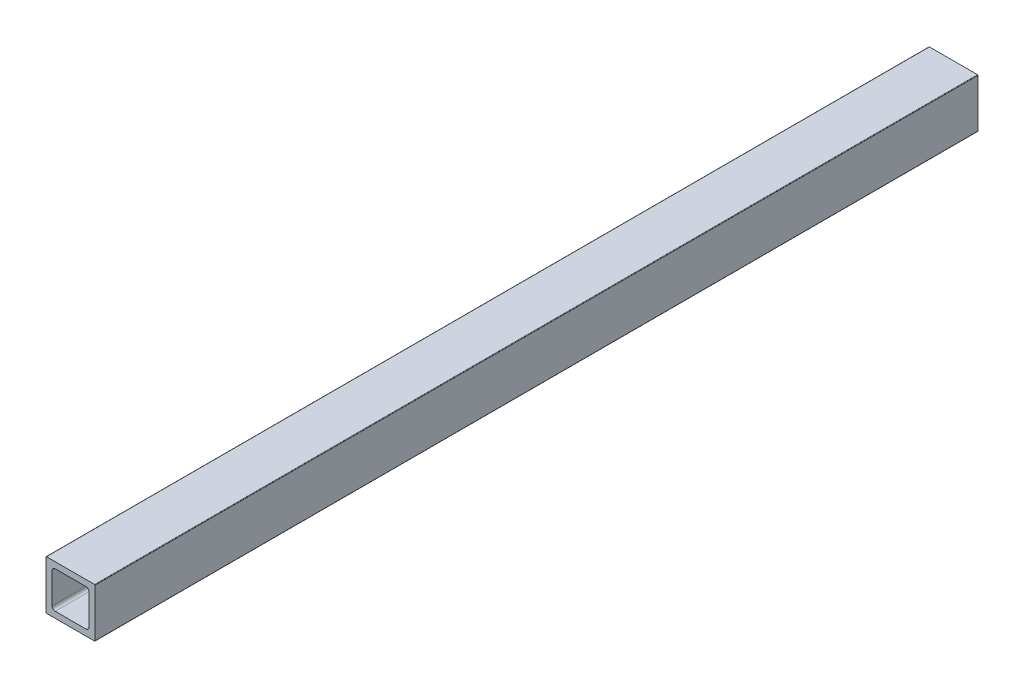
ISO-10303-21;
HEADER;
FILE_DESCRIPTION(('STEP AP214'),'2;1');
FILE_NAME('part.step','',(''),(''),'','','');
FILE_SCHEMA(('AUTOMOTIVE_DESIGN { 1 0 10303 214 1 1 1 1 }'));
ENDSEC;
DATA;
#1=APPLICATION_CONTEXT('core data for automotive mechanical design processes');
#2=APPLICATION_PROTOCOL_DEFINITION('international standard','automotive_design',2000,#1);
#3=PRODUCT_CONTEXT('',#1,'mechanical');
#4=PRODUCT('Part','Part','',(#3));
#5=PRODUCT_RELATED_PRODUCT_CATEGORY('part','',(#4));
#6=PRODUCT_DEFINITION_FORMATION('','',#4);
#7=PRODUCT_DEFINITION_CONTEXT('part definition',#1,'design');
#8=PRODUCT_DEFINITION('design','',#6,#7);
#9=PRODUCT_DEFINITION_SHAPE('','',#8);
#10=(LENGTH_UNIT() NAMED_UNIT(*) SI_UNIT(.MILLI.,.METRE.));
#11=(NAMED_UNIT(*) PLANE_ANGLE_UNIT() SI_UNIT($,.RADIAN.));
#12=(NAMED_UNIT(*) SI_UNIT($,.STERADIAN.) SOLID_ANGLE_UNIT());
#13=UNCERTAINTY_MEASURE_WITH_UNIT(LENGTH_MEASURE(1.E-05),#10,'distance_accuracy_value','');
#14=(GEOMETRIC_REPRESENTATION_CONTEXT(3) GLOBAL_UNCERTAINTY_ASSIGNED_CONTEXT((#13)) GLOBAL_UNIT_ASSIGNED_CONTEXT((#10,
#11,#12)) REPRESENTATION_CONTEXT('',''));
#15=CARTESIAN_POINT('',(0.,0.,0.));
#16=DIRECTION('',(0.,0.,1.));
#17=DIRECTION('',(1.,0.,0.));
#18=AXIS2_PLACEMENT_3D('',#15,#16,#17);
#19=CARTESIAN_POINT('',(0.253999999999993,0.253999999999998,457.2));
#20=DIRECTION('',(0.,0.,-1.));
#21=DIRECTION('',(-1.,0.,0.));
#22=AXIS2_PLACEMENT_3D('',#19,#20,#21);
#23=CYLINDRICAL_SURFACE('',#22,0.253999999999997);
#24=CARTESIAN_POINT('',(0.253999999999993,0.253999999999998,0.));
#25=DIRECTION('',(0.,0.,-1.));
#26=DIRECTION('',(-1.,0.,0.));
#27=AXIS2_PLACEMENT_3D('',#24,#25,#26);
#28=CIRCLE('',#27,0.253999999999997);
#29=CARTESIAN_POINT('',(0.253999999999993,0.,0.));
#30=VERTEX_POINT('',#29);
#31=CARTESIAN_POINT('',(0.,0.253999999999998,0.));
#32=VERTEX_POINT('',#31);
#33=EDGE_CURVE('E203',#30,#32,#28,.T.);
#34=ORIENTED_EDGE('',*,*,#33,.F.);
#35=DIRECTION('',(0.,0.,-1.));
#36=VECTOR('',#35,1.);
#37=CARTESIAN_POINT('',(0.253999999999993,0.,457.2));
#38=LINE('',#37,#36);
#39=CARTESIAN_POINT('',(0.253999999999993,0.,457.2));
#40=VERTEX_POINT('',#39);
#41=EDGE_CURVE('E11',#40,#30,#38,.T.);
#42=ORIENTED_EDGE('',*,*,#41,.F.);
#43=CARTESIAN_POINT('',(0.253999999999993,0.253999999999998,457.2));
#44=DIRECTION('',(0.,0.,-1.));
#45=DIRECTION('',(-1.,0.,0.));
#46=AXIS2_PLACEMENT_3D('',#43,#44,#45);
#47=CIRCLE('',#46,0.253999999999997);
#48=CARTESIAN_POINT('',(0.,0.253999999999998,457.2));
#49=VERTEX_POINT('',#48);
#50=EDGE_CURVE('E215',#40,#49,#47,.T.);
#51=ORIENTED_EDGE('',*,*,#50,.T.);
#52=DIRECTION('',(0.,0.,-1.));
#53=VECTOR('',#52,1.);
#54=CARTESIAN_POINT('',(0.,0.253999999999998,457.2));
#55=LINE('',#54,#53);
#56=EDGE_CURVE('E36',#49,#32,#55,.T.);
#57=ORIENTED_EDGE('',*,*,#56,.T.);
#58=EDGE_LOOP('',(#34,#42,#51,#57));
#59=FACE_BOUND('',#58,.T.);
#60=ADVANCED_FACE('F33',(#59),#23,.T.);
#61=CARTESIAN_POINT('',(25.146,0.,457.2));
#62=DIRECTION('',(0.,-1.,0.));
#63=DIRECTION('',(1.,0.,0.));
#64=AXIS2_PLACEMENT_3D('',#61,#62,#63);
#65=PLANE('',#64);
#66=DIRECTION('',(-1.,0.,0.));
#67=VECTOR('',#66,1.);
#68=CARTESIAN_POINT('',(25.146,0.,0.));
#69=LINE('',#68,#67);
#70=CARTESIAN_POINT('',(25.146,0.,0.));
#71=VERTEX_POINT('',#70);
#72=EDGE_CURVE('E219',#71,#30,#69,.T.);
#73=ORIENTED_EDGE('',*,*,#72,.F.);
#74=DIRECTION('',(0.,0.,-1.));
#75=VECTOR('',#74,1.);
#76=CARTESIAN_POINT('',(25.146,0.,457.2));
#77=LINE('',#76,#75);
#78=CARTESIAN_POINT('',(25.146,0.,457.2));
#79=VERTEX_POINT('',#78);
#80=EDGE_CURVE('E41',#79,#71,#77,.T.);
#81=ORIENTED_EDGE('',*,*,#80,.F.);
#82=DIRECTION('',(-1.,0.,0.));
#83=VECTOR('',#82,1.);
#84=CARTESIAN_POINT('',(25.146,0.,457.2));
#85=LINE('',#84,#83);
#86=EDGE_CURVE('E237',#79,#40,#85,.T.);
#87=ORIENTED_EDGE('',*,*,#86,.T.);
#88=ORIENTED_EDGE('',*,*,#41,.T.);
#89=EDGE_LOOP('',(#73,#81,#87,#88));
#90=FACE_BOUND('',#89,.T.);
#91=ADVANCED_FACE('F284',(#90),#65,.T.);
#92=CARTESIAN_POINT('',(25.146,0.254,457.2));
#93=DIRECTION('',(0.,0.,-1.));
#94=DIRECTION('',(-1.,0.,0.));
#95=AXIS2_PLACEMENT_3D('',#92,#93,#94);
#96=CYLINDRICAL_SURFACE('',#95,0.253999999999999);
#97=CARTESIAN_POINT('',(25.146,0.254,0.));
#98=DIRECTION('',(0.,0.,-1.));
#99=DIRECTION('',(-1.,0.,0.));
#100=AXIS2_PLACEMENT_3D('',#97,#98,#99);
#101=CIRCLE('',#100,0.253999999999999);
#102=CARTESIAN_POINT('',(25.4,0.254,0.));
#103=VERTEX_POINT('',#102);
#104=EDGE_CURVE('E257',#103,#71,#101,.T.);
#105=ORIENTED_EDGE('',*,*,#104,.F.);
#106=DIRECTION('',(0.,0.,-1.));
#107=VECTOR('',#106,1.);
#108=CARTESIAN_POINT('',(25.4,0.254,457.2));
#109=LINE('',#108,#107);
#110=CARTESIAN_POINT('',(25.4,0.254,457.2));
#111=VERTEX_POINT('',#110);
#112=EDGE_CURVE('E263',#111,#103,#109,.T.);
#113=ORIENTED_EDGE('',*,*,#112,.F.);
#114=CARTESIAN_POINT('',(25.146,0.254,457.2));
#115=DIRECTION('',(0.,0.,-1.));
#116=DIRECTION('',(-1.,0.,0.));
#117=AXIS2_PLACEMENT_3D('',#114,#115,#116);
#118=CIRCLE('',#117,0.253999999999999);
#119=EDGE_CURVE('E234',#111,#79,#118,.T.);
#120=ORIENTED_EDGE('',*,*,#119,.T.);
#121=ORIENTED_EDGE('',*,*,#80,.T.);
#122=EDGE_LOOP('',(#105,#113,#120,#121));
#123=FACE_BOUND('',#122,.T.);
#124=ADVANCED_FACE('F303',(#123),#96,.T.);
#125=CARTESIAN_POINT('',(25.4,25.146,457.2));
#126=DIRECTION('',(1.,0.,0.));
#127=DIRECTION('',(0.,0.,-1.));
#128=AXIS2_PLACEMENT_3D('',#125,#126,#127);
#129=PLANE('',#128);
#130=DIRECTION('',(0.,-1.,0.));
#131=VECTOR('',#130,1.);
#132=CARTESIAN_POINT('',(25.4,25.146,0.));
#133=LINE('',#132,#131);
#134=CARTESIAN_POINT('',(25.4,25.146,0.));
#135=VERTEX_POINT('',#134);
#136=EDGE_CURVE('E254',#135,#103,#133,.T.);
#137=ORIENTED_EDGE('',*,*,#136,.F.);
#138=DIRECTION('',(0.,0.,-1.));
#139=VECTOR('',#138,1.);
#140=CARTESIAN_POINT('',(25.4,25.146,457.2));
#141=LINE('',#140,#139);
#142=CARTESIAN_POINT('',(25.4,25.146,457.2));
#143=VERTEX_POINT('',#142);
#144=EDGE_CURVE('E265',#143,#135,#141,.T.);
#145=ORIENTED_EDGE('',*,*,#144,.F.);
#146=DIRECTION('',(0.,-1.,0.));
#147=VECTOR('',#146,1.);
#148=CARTESIAN_POINT('',(25.4,25.146,457.2));
#149=LINE('',#148,#147);
#150=EDGE_CURVE('E231',#143,#111,#149,.T.);
#151=ORIENTED_EDGE('',*,*,#150,.T.);
#152=ORIENTED_EDGE('',*,*,#112,.T.);
#153=EDGE_LOOP('',(#137,#145,#151,#152));
#154=FACE_BOUND('',#153,.T.);
#155=ADVANCED_FACE('F301',(#154),#129,.T.);
#156=CARTESIAN_POINT('',(25.146,25.146,457.2));
#157=DIRECTION('',(0.,0.,-1.));
#158=DIRECTION('',(-1.,0.,0.));
#159=AXIS2_PLACEMENT_3D('',#156,#157,#158);
#160=CYLINDRICAL_SURFACE('',#159,0.253999999999999);
#161=CARTESIAN_POINT('',(25.146,25.146,0.));
#162=DIRECTION('',(0.,0.,-1.));
#163=DIRECTION('',(-1.,0.,0.));
#164=AXIS2_PLACEMENT_3D('',#161,#162,#163);
#165=CIRCLE('',#164,0.253999999999999);
#166=CARTESIAN_POINT('',(25.146,25.4,0.));
#167=VERTEX_POINT('',#166);
#168=EDGE_CURVE('E251',#167,#135,#165,.T.);
#169=ORIENTED_EDGE('',*,*,#168,.F.);
#170=DIRECTION('',(0.,0.,-1.));
#171=VECTOR('',#170,1.);
#172=CARTESIAN_POINT('',(25.146,25.4,457.2));
#173=LINE('',#172,#171);
#174=CARTESIAN_POINT('',(25.146,25.4,457.2));
#175=VERTEX_POINT('',#174);
#176=EDGE_CURVE('E267',#175,#167,#173,.T.);
#177=ORIENTED_EDGE('',*,*,#176,.F.);
#178=CARTESIAN_POINT('',(25.146,25.146,457.2));
#179=DIRECTION('',(0.,0.,-1.));
#180=DIRECTION('',(-1.,0.,0.));
#181=AXIS2_PLACEMENT_3D('',#178,#179,#180);
#182=CIRCLE('',#181,0.253999999999999);
#183=EDGE_CURVE('E228',#175,#143,#182,.T.);
#184=ORIENTED_EDGE('',*,*,#183,.T.);
#185=ORIENTED_EDGE('',*,*,#144,.T.);
#186=EDGE_LOOP('',(#169,#177,#184,#185));
#187=FACE_BOUND('',#186,.T.);
#188=ADVANCED_FACE('F297',(#187),#160,.T.);
#189=CARTESIAN_POINT('',(0.253999999999988,25.4,457.2));
#190=DIRECTION('',(0.,1.,0.));
#191=DIRECTION('',(-1.,0.,0.));
#192=AXIS2_PLACEMENT_3D('',#189,#190,#191);
#193=PLANE('',#192);
#194=DIRECTION('',(1.,0.,0.));
#195=VECTOR('',#194,1.);
#196=CARTESIAN_POINT('',(0.253999999999988,25.4,0.));
#197=LINE('',#196,#195);
#198=CARTESIAN_POINT('',(0.253999999999988,25.4,0.));
#199=VERTEX_POINT('',#198);
#200=EDGE_CURVE('E248',#199,#167,#197,.T.);
#201=ORIENTED_EDGE('',*,*,#200,.F.);
#202=DIRECTION('',(0.,0.,-1.));
#203=VECTOR('',#202,1.);
#204=CARTESIAN_POINT('',(0.253999999999988,25.4,457.2));
#205=LINE('',#204,#203);
#206=CARTESIAN_POINT('',(0.253999999999988,25.4,457.2));
#207=VERTEX_POINT('',#206);
#208=EDGE_CURVE('E269',#207,#199,#205,.T.);
#209=ORIENTED_EDGE('',*,*,#208,.F.);
#210=DIRECTION('',(1.,0.,0.));
#211=VECTOR('',#210,1.);
#212=CARTESIAN_POINT('',(0.253999999999988,25.4,457.2));
#213=LINE('',#212,#211);
#214=EDGE_CURVE('E225',#207,#175,#213,.T.);
#215=ORIENTED_EDGE('',*,*,#214,.T.);
#216=ORIENTED_EDGE('',*,*,#176,.T.);
#217=EDGE_LOOP('',(#201,#209,#215,#216));
#218=FACE_BOUND('',#217,.T.);
#219=ADVANCED_FACE('F295',(#218),#193,.T.);
#220=CARTESIAN_POINT('',(0.253999999999988,25.146,457.2));
#221=DIRECTION('',(0.,0.,-1.));
#222=DIRECTION('',(-1.,0.,0.));
#223=AXIS2_PLACEMENT_3D('',#220,#221,#222);
#224=CYLINDRICAL_SURFACE('',#223,0.253999999999991);
#225=CARTESIAN_POINT('',(0.253999999999988,25.146,0.));
#226=DIRECTION('',(0.,0.,-1.));
#227=DIRECTION('',(-1.,0.,0.));
#228=AXIS2_PLACEMENT_3D('',#225,#226,#227);
#229=CIRCLE('',#228,0.253999999999991);
#230=CARTESIAN_POINT('',(0.,25.146,0.));
#231=VERTEX_POINT('',#230);
#232=EDGE_CURVE('E245',#231,#199,#229,.T.);
#233=ORIENTED_EDGE('',*,*,#232,.F.);
#234=DIRECTION('',(0.,0.,-1.));
#235=VECTOR('',#234,1.);
#236=CARTESIAN_POINT('',(0.,25.146,457.2));
#237=LINE('',#236,#235);
#238=CARTESIAN_POINT('',(0.,25.146,457.2));
#239=VERTEX_POINT('',#238);
#240=EDGE_CURVE('E270',#239,#231,#237,.T.);
#241=ORIENTED_EDGE('',*,*,#240,.F.);
#242=CARTESIAN_POINT('',(0.253999999999988,25.146,457.2));
#243=DIRECTION('',(0.,0.,-1.));
#244=DIRECTION('',(-1.,0.,0.));
#245=AXIS2_PLACEMENT_3D('',#242,#243,#244);
#246=CIRCLE('',#245,0.253999999999991);
#247=EDGE_CURVE('E222',#239,#207,#246,.T.);
#248=ORIENTED_EDGE('',*,*,#247,.T.);
#249=ORIENTED_EDGE('',*,*,#208,.T.);
#250=EDGE_LOOP('',(#233,#241,#248,#249));
#251=FACE_BOUND('',#250,.T.);
#252=ADVANCED_FACE('F291',(#251),#224,.T.);
#253=CARTESIAN_POINT('',(0.,0.253999999999998,457.2));
#254=DIRECTION('',(-1.,0.,0.));
#255=DIRECTION('',(0.,0.,1.));
#256=AXIS2_PLACEMENT_3D('',#253,#254,#255);
#257=PLANE('',#256);
#258=DIRECTION('',(0.,1.,0.));
#259=VECTOR('',#258,1.);
#260=CARTESIAN_POINT('',(0.,0.253999999999998,0.));
#261=LINE('',#260,#259);
#262=EDGE_CURVE('E242',#32,#231,#261,.T.);
#263=ORIENTED_EDGE('',*,*,#262,.F.);
#264=ORIENTED_EDGE('',*,*,#56,.F.);
#265=DIRECTION('',(0.,1.,0.));
#266=VECTOR('',#265,1.);
#267=CARTESIAN_POINT('',(0.,0.253999999999998,457.2));
#268=LINE('',#267,#266);
#269=EDGE_CURVE('E218',#49,#239,#268,.T.);
#270=ORIENTED_EDGE('',*,*,#269,.T.);
#271=ORIENTED_EDGE('',*,*,#240,.T.);
#272=EDGE_LOOP('',(#263,#264,#270,#271));
#273=FACE_BOUND('',#272,.T.);
#274=ADVANCED_FACE('F278',(#273),#257,.T.);
#275=CARTESIAN_POINT('',(0.253999999999993,0.253999999999998,457.2));
#276=DIRECTION('',(0.,0.,-1.));
#277=DIRECTION('',(-1.,0.,0.));
#278=AXIS2_PLACEMENT_3D('',#275,#276,#277);
#279=PLANE('',#278);
#280=DIRECTION('',(0.,1.,0.));
#281=VECTOR('',#280,1.);
#282=CARTESIAN_POINT('',(3.175,20.6375,457.2));
#283=LINE('',#282,#281);
#284=CARTESIAN_POINT('',(3.175,4.7625,457.2));
#285=VERTEX_POINT('',#284);
#286=CARTESIAN_POINT('',(3.175,20.6375,457.2));
#287=VERTEX_POINT('',#286);
#288=EDGE_CURVE('E154',#285,#287,#283,.T.);
#289=ORIENTED_EDGE('',*,*,#288,.T.);
#290=CARTESIAN_POINT('',(4.76250000000001,20.6375,457.2));
#291=DIRECTION('',(0.,0.,-1.));
#292=DIRECTION('',(1.,0.,0.));
#293=AXIS2_PLACEMENT_3D('',#290,#291,#292);
#294=CIRCLE('',#293,1.58750000000001);
#295=CARTESIAN_POINT('',(4.76250000000001,22.225,457.2));
#296=VERTEX_POINT('',#295);
#297=EDGE_CURVE('E148',#287,#296,#294,.T.);
#298=ORIENTED_EDGE('',*,*,#297,.T.);
#299=DIRECTION('',(1.,0.,0.));
#300=VECTOR('',#299,1.);
#301=CARTESIAN_POINT('',(20.6375,22.225,457.2));
#302=LINE('',#301,#300);
#303=CARTESIAN_POINT('',(20.6375,22.225,457.2));
#304=VERTEX_POINT('',#303);
#305=EDGE_CURVE('E157',#296,#304,#302,.T.);
#306=ORIENTED_EDGE('',*,*,#305,.T.);
#307=CARTESIAN_POINT('',(20.6375,20.6375,457.2));
#308=DIRECTION('',(0.,0.,-1.));
#309=DIRECTION('',(1.,0.,0.));
#310=AXIS2_PLACEMENT_3D('',#307,#308,#309);
#311=CIRCLE('',#310,1.5875);
#312=CARTESIAN_POINT('',(22.225,20.6375,457.2));
#313=VERTEX_POINT('',#312);
#314=EDGE_CURVE('E49',#304,#313,#311,.T.);
#315=ORIENTED_EDGE('',*,*,#314,.T.);
#316=DIRECTION('',(0.,-1.,0.));
#317=VECTOR('',#316,1.);
#318=CARTESIAN_POINT('',(22.225,4.7625,457.2));
#319=LINE('',#318,#317);
#320=CARTESIAN_POINT('',(22.225,4.7625,457.2));
#321=VERTEX_POINT('',#320);
#322=EDGE_CURVE('E172',#313,#321,#319,.T.);
#323=ORIENTED_EDGE('',*,*,#322,.T.);
#324=CARTESIAN_POINT('',(20.6375,4.7625,457.2));
#325=DIRECTION('',(0.,0.,-1.));
#326=DIRECTION('',(1.,0.,0.));
#327=AXIS2_PLACEMENT_3D('',#324,#325,#326);
#328=CIRCLE('',#327,1.5875);
#329=CARTESIAN_POINT('',(20.6375,3.175,457.2));
#330=VERTEX_POINT('',#329);
#331=EDGE_CURVE('E175',#321,#330,#328,.T.);
#332=ORIENTED_EDGE('',*,*,#331,.T.);
#333=DIRECTION('',(-1.,0.,0.));
#334=VECTOR('',#333,1.);
#335=CARTESIAN_POINT('',(4.7625,3.175,457.2));
#336=LINE('',#335,#334);
#337=CARTESIAN_POINT('',(4.7625,3.175,457.2));
#338=VERTEX_POINT('',#337);
#339=EDGE_CURVE('E178',#330,#338,#336,.T.);
#340=ORIENTED_EDGE('',*,*,#339,.T.);
#341=CARTESIAN_POINT('',(4.7625,4.7625,457.2));
#342=DIRECTION('',(0.,0.,-1.));
#343=DIRECTION('',(1.,0.,0.));
#344=AXIS2_PLACEMENT_3D('',#341,#342,#343);
#345=CIRCLE('',#344,1.5875);
#346=EDGE_CURVE('E181',#338,#285,#345,.T.);
#347=ORIENTED_EDGE('',*,*,#346,.T.);
#348=EDGE_LOOP('',(#289,#298,#306,#315,#323,#332,#340,#347));
#349=FACE_BOUND('',#348,.T.);
#350=ORIENTED_EDGE('',*,*,#50,.F.);
#351=ORIENTED_EDGE('',*,*,#86,.F.);
#352=ORIENTED_EDGE('',*,*,#119,.F.);
#353=ORIENTED_EDGE('',*,*,#150,.F.);
#354=ORIENTED_EDGE('',*,*,#183,.F.);
#355=ORIENTED_EDGE('',*,*,#214,.F.);
#356=ORIENTED_EDGE('',*,*,#247,.F.);
#357=ORIENTED_EDGE('',*,*,#269,.F.);
#358=EDGE_LOOP('',(#350,#351,#352,#353,#354,#355,#356,#357));
#359=FACE_BOUND('',#358,.T.);
#360=ADVANCED_FACE('F161',(#349,#359),#279,.F.);
#361=CARTESIAN_POINT('',(0.253999999999993,0.253999999999998,0.));
#362=DIRECTION('',(0.,0.,-1.));
#363=DIRECTION('',(-1.,0.,0.));
#364=AXIS2_PLACEMENT_3D('',#361,#362,#363);
#365=PLANE('',#364);
#366=CARTESIAN_POINT('',(4.76250000000001,20.6375,0.));
#367=DIRECTION('',(0.,0.,-1.));
#368=DIRECTION('',(1.,0.,0.));
#369=AXIS2_PLACEMENT_3D('',#366,#367,#368);
#370=CIRCLE('',#369,1.58750000000001);
#371=CARTESIAN_POINT('',(3.175,20.6375,0.));
#372=VERTEX_POINT('',#371);
#373=CARTESIAN_POINT('',(4.76250000000001,22.225,0.));
#374=VERTEX_POINT('',#373);
#375=EDGE_CURVE('E57',#372,#374,#370,.T.);
#376=ORIENTED_EDGE('',*,*,#375,.F.);
#377=DIRECTION('',(0.,1.,0.));
#378=VECTOR('',#377,1.);
#379=CARTESIAN_POINT('',(3.175,20.6375,0.));
#380=LINE('',#379,#378);
#381=CARTESIAN_POINT('',(3.175,4.7625,0.));
#382=VERTEX_POINT('',#381);
#383=EDGE_CURVE('E165',#382,#372,#380,.T.);
#384=ORIENTED_EDGE('',*,*,#383,.F.);
#385=CARTESIAN_POINT('',(4.7625,4.7625,0.));
#386=DIRECTION('',(0.,0.,-1.));
#387=DIRECTION('',(1.,0.,0.));
#388=AXIS2_PLACEMENT_3D('',#385,#386,#387);
#389=CIRCLE('',#388,1.5875);
#390=CARTESIAN_POINT('',(4.7625,3.175,0.));
#391=VERTEX_POINT('',#390);
#392=EDGE_CURVE('E168',#391,#382,#389,.T.);
#393=ORIENTED_EDGE('',*,*,#392,.F.);
#394=DIRECTION('',(-1.,0.,0.));
#395=VECTOR('',#394,1.);
#396=CARTESIAN_POINT('',(4.7625,3.175,0.));
#397=LINE('',#396,#395);
#398=CARTESIAN_POINT('',(20.6375,3.175,0.));
#399=VERTEX_POINT('',#398);
#400=EDGE_CURVE('E196',#399,#391,#397,.T.);
#401=ORIENTED_EDGE('',*,*,#400,.F.);
#402=CARTESIAN_POINT('',(20.6375,4.7625,0.));
#403=DIRECTION('',(0.,0.,-1.));
#404=DIRECTION('',(1.,0.,0.));
#405=AXIS2_PLACEMENT_3D('',#402,#403,#404);
#406=CIRCLE('',#405,1.5875);
#407=CARTESIAN_POINT('',(22.225,4.7625,0.));
#408=VERTEX_POINT('',#407);
#409=EDGE_CURVE('E193',#408,#399,#406,.T.);
#410=ORIENTED_EDGE('',*,*,#409,.F.);
#411=DIRECTION('',(0.,-1.,0.));
#412=VECTOR('',#411,1.);
#413=CARTESIAN_POINT('',(22.225,4.7625,0.));
#414=LINE('',#413,#412);
#415=CARTESIAN_POINT('',(22.225,20.6375,0.));
#416=VERTEX_POINT('',#415);
#417=EDGE_CURVE('E190',#416,#408,#414,.T.);
#418=ORIENTED_EDGE('',*,*,#417,.F.);
#419=CARTESIAN_POINT('',(20.6375,20.6375,0.));
#420=DIRECTION('',(0.,0.,-1.));
#421=DIRECTION('',(1.,0.,0.));
#422=AXIS2_PLACEMENT_3D('',#419,#420,#421);
#423=CIRCLE('',#422,1.5875);
#424=CARTESIAN_POINT('',(20.6375,22.225,0.));
#425=VERTEX_POINT('',#424);
#426=EDGE_CURVE('E187',#425,#416,#423,.T.);
#427=ORIENTED_EDGE('',*,*,#426,.F.);
#428=DIRECTION('',(1.,0.,0.));
#429=VECTOR('',#428,1.);
#430=CARTESIAN_POINT('',(20.6375,22.225,0.));
#431=LINE('',#430,#429);
#432=EDGE_CURVE('E185',#374,#425,#431,.T.);
#433=ORIENTED_EDGE('',*,*,#432,.F.);
#434=EDGE_LOOP('',(#376,#384,#393,#401,#410,#418,#427,#433));
#435=FACE_BOUND('',#434,.T.);
#436=ORIENTED_EDGE('',*,*,#33,.T.);
#437=ORIENTED_EDGE('',*,*,#262,.T.);
#438=ORIENTED_EDGE('',*,*,#232,.T.);
#439=ORIENTED_EDGE('',*,*,#200,.T.);
#440=ORIENTED_EDGE('',*,*,#168,.T.);
#441=ORIENTED_EDGE('',*,*,#136,.T.);
#442=ORIENTED_EDGE('',*,*,#104,.T.);
#443=ORIENTED_EDGE('',*,*,#72,.T.);
#444=EDGE_LOOP('',(#436,#437,#438,#439,#440,#441,#442,#443));
#445=FACE_BOUND('',#444,.T.);
#446=ADVANCED_FACE('F280',(#435,#445),#365,.T.);
#447=CARTESIAN_POINT('',(4.76250000000001,20.6375,457.2));
#448=DIRECTION('',(0.,0.,-1.));
#449=DIRECTION('',(-1.,0.,0.));
#450=AXIS2_PLACEMENT_3D('',#447,#448,#449);
#451=CYLINDRICAL_SURFACE('',#450,1.58750000000001);
#452=ORIENTED_EDGE('',*,*,#375,.T.);
#453=DIRECTION('',(0.,0.,-1.));
#454=VECTOR('',#453,1.);
#455=CARTESIAN_POINT('',(4.76250000000001,22.225,457.2));
#456=LINE('',#455,#454);
#457=EDGE_CURVE('E144',#296,#374,#456,.T.);
#458=ORIENTED_EDGE('',*,*,#457,.F.);
#459=ORIENTED_EDGE('',*,*,#297,.F.);
#460=DIRECTION('',(0.,0.,-1.));
#461=VECTOR('',#460,1.);
#462=CARTESIAN_POINT('',(3.175,20.6375,457.2));
#463=LINE('',#462,#461);
#464=EDGE_CURVE('E201',#287,#372,#463,.T.);
#465=ORIENTED_EDGE('',*,*,#464,.T.);
#466=EDGE_LOOP('',(#452,#458,#459,#465));
#467=FACE_BOUND('',#466,.T.);
#468=ADVANCED_FACE('F146',(#467),#451,.F.);
#469=CARTESIAN_POINT('',(3.175,20.6375,457.2));
#470=DIRECTION('',(-1.,0.,0.));
#471=DIRECTION('',(0.,-1.,0.));
#472=AXIS2_PLACEMENT_3D('',#469,#470,#471);
#473=PLANE('',#472);
#474=ORIENTED_EDGE('',*,*,#383,.T.);
#475=ORIENTED_EDGE('',*,*,#464,.F.);
#476=ORIENTED_EDGE('',*,*,#288,.F.);
#477=DIRECTION('',(0.,0.,-1.));
#478=VECTOR('',#477,1.);
#479=CARTESIAN_POINT('',(3.175,4.7625,457.2));
#480=LINE('',#479,#478);
#481=EDGE_CURVE('E204',#285,#382,#480,.T.);
#482=ORIENTED_EDGE('',*,*,#481,.T.);
#483=EDGE_LOOP('',(#474,#475,#476,#482));
#484=FACE_BOUND('',#483,.T.);
#485=ADVANCED_FACE('F386',(#484),#473,.F.);
#486=CARTESIAN_POINT('',(4.7625,4.7625,457.2));
#487=DIRECTION('',(0.,0.,-1.));
#488=DIRECTION('',(-1.,0.,0.));
#489=AXIS2_PLACEMENT_3D('',#486,#487,#488);
#490=CYLINDRICAL_SURFACE('',#489,1.5875);
#491=ORIENTED_EDGE('',*,*,#392,.T.);
#492=ORIENTED_EDGE('',*,*,#481,.F.);
#493=ORIENTED_EDGE('',*,*,#346,.F.);
#494=DIRECTION('',(0.,0.,-1.));
#495=VECTOR('',#494,1.);
#496=CARTESIAN_POINT('',(4.7625,3.175,457.2));
#497=LINE('',#496,#495);
#498=EDGE_CURVE('E206',#338,#391,#497,.T.);
#499=ORIENTED_EDGE('',*,*,#498,.T.);
#500=EDGE_LOOP('',(#491,#492,#493,#499));
#501=FACE_BOUND('',#500,.T.);
#502=ADVANCED_FACE('F395',(#501),#490,.F.);
#503=CARTESIAN_POINT('',(4.7625,3.175,457.2));
#504=DIRECTION('',(0.,-1.,0.));
#505=DIRECTION('',(1.,0.,0.));
#506=AXIS2_PLACEMENT_3D('',#503,#504,#505);
#507=PLANE('',#506);
#508=ORIENTED_EDGE('',*,*,#400,.T.);
#509=ORIENTED_EDGE('',*,*,#498,.F.);
#510=ORIENTED_EDGE('',*,*,#339,.F.);
#511=DIRECTION('',(0.,0.,-1.));
#512=VECTOR('',#511,1.);
#513=CARTESIAN_POINT('',(20.6375,3.175,457.2));
#514=LINE('',#513,#512);
#515=EDGE_CURVE('E208',#330,#399,#514,.T.);
#516=ORIENTED_EDGE('',*,*,#515,.T.);
#517=EDGE_LOOP('',(#508,#509,#510,#516));
#518=FACE_BOUND('',#517,.T.);
#519=ADVANCED_FACE('F405',(#518),#507,.F.);
#520=CARTESIAN_POINT('',(20.6375,4.7625,457.2));
#521=DIRECTION('',(0.,0.,-1.));
#522=DIRECTION('',(-1.,0.,0.));
#523=AXIS2_PLACEMENT_3D('',#520,#521,#522);
#524=CYLINDRICAL_SURFACE('',#523,1.5875);
#525=ORIENTED_EDGE('',*,*,#409,.T.);
#526=ORIENTED_EDGE('',*,*,#515,.F.);
#527=ORIENTED_EDGE('',*,*,#331,.F.);
#528=DIRECTION('',(0.,0.,-1.));
#529=VECTOR('',#528,1.);
#530=CARTESIAN_POINT('',(22.225,4.7625,457.2));
#531=LINE('',#530,#529);
#532=EDGE_CURVE('E210',#321,#408,#531,.T.);
#533=ORIENTED_EDGE('',*,*,#532,.T.);
#534=EDGE_LOOP('',(#525,#526,#527,#533));
#535=FACE_BOUND('',#534,.T.);
#536=ADVANCED_FACE('F415',(#535),#524,.F.);
#537=CARTESIAN_POINT('',(22.225,4.7625,457.2));
#538=DIRECTION('',(1.,0.,0.));
#539=DIRECTION('',(0.,1.,0.));
#540=AXIS2_PLACEMENT_3D('',#537,#538,#539);
#541=PLANE('',#540);
#542=ORIENTED_EDGE('',*,*,#417,.T.);
#543=ORIENTED_EDGE('',*,*,#532,.F.);
#544=ORIENTED_EDGE('',*,*,#322,.F.);
#545=DIRECTION('',(0.,0.,-1.));
#546=VECTOR('',#545,1.);
#547=CARTESIAN_POINT('',(22.225,20.6375,457.2));
#548=LINE('',#547,#546);
#549=EDGE_CURVE('E212',#313,#416,#548,.T.);
#550=ORIENTED_EDGE('',*,*,#549,.T.);
#551=EDGE_LOOP('',(#542,#543,#544,#550));
#552=FACE_BOUND('',#551,.T.);
#553=ADVANCED_FACE('F425',(#552),#541,.F.);
#554=CARTESIAN_POINT('',(20.6375,20.6375,457.2));
#555=DIRECTION('',(0.,0.,-1.));
#556=DIRECTION('',(-1.,0.,0.));
#557=AXIS2_PLACEMENT_3D('',#554,#555,#556);
#558=CYLINDRICAL_SURFACE('',#557,1.5875);
#559=ORIENTED_EDGE('',*,*,#426,.T.);
#560=ORIENTED_EDGE('',*,*,#549,.F.);
#561=ORIENTED_EDGE('',*,*,#314,.F.);
#562=DIRECTION('',(0.,0.,-1.));
#563=VECTOR('',#562,1.);
#564=CARTESIAN_POINT('',(20.6375,22.225,457.2));
#565=LINE('',#564,#563);
#566=EDGE_CURVE('E153',#304,#425,#565,.T.);
#567=ORIENTED_EDGE('',*,*,#566,.T.);
#568=EDGE_LOOP('',(#559,#560,#561,#567));
#569=FACE_BOUND('',#568,.T.);
#570=ADVANCED_FACE('F435',(#569),#558,.F.);
#571=CARTESIAN_POINT('',(20.6375,22.225,457.2));
#572=DIRECTION('',(0.,1.,0.));
#573=DIRECTION('',(-1.,0.,0.));
#574=AXIS2_PLACEMENT_3D('',#571,#572,#573);
#575=PLANE('',#574);
#576=ORIENTED_EDGE('',*,*,#432,.T.);
#577=ORIENTED_EDGE('',*,*,#566,.F.);
#578=ORIENTED_EDGE('',*,*,#305,.F.);
#579=ORIENTED_EDGE('',*,*,#457,.T.);
#580=EDGE_LOOP('',(#576,#577,#578,#579));
#581=FACE_BOUND('',#580,.T.);
#582=ADVANCED_FACE('F158',(#581),#575,.F.);
#583=CLOSED_SHELL('',(#60,#91,#124,#155,#188,#219,#252,#274,#360,#446,#468,#485,#502,#519,#536,
#553,#570,#582));
#584=MANIFOLD_SOLID_BREP('B2',#583);
#585=ADVANCED_BREP_SHAPE_REPRESENTATION('',(#18,#584),#14);
#586=SHAPE_DEFINITION_REPRESENTATION(#9,#585);
ENDSEC;
END-ISO-10303-21;
